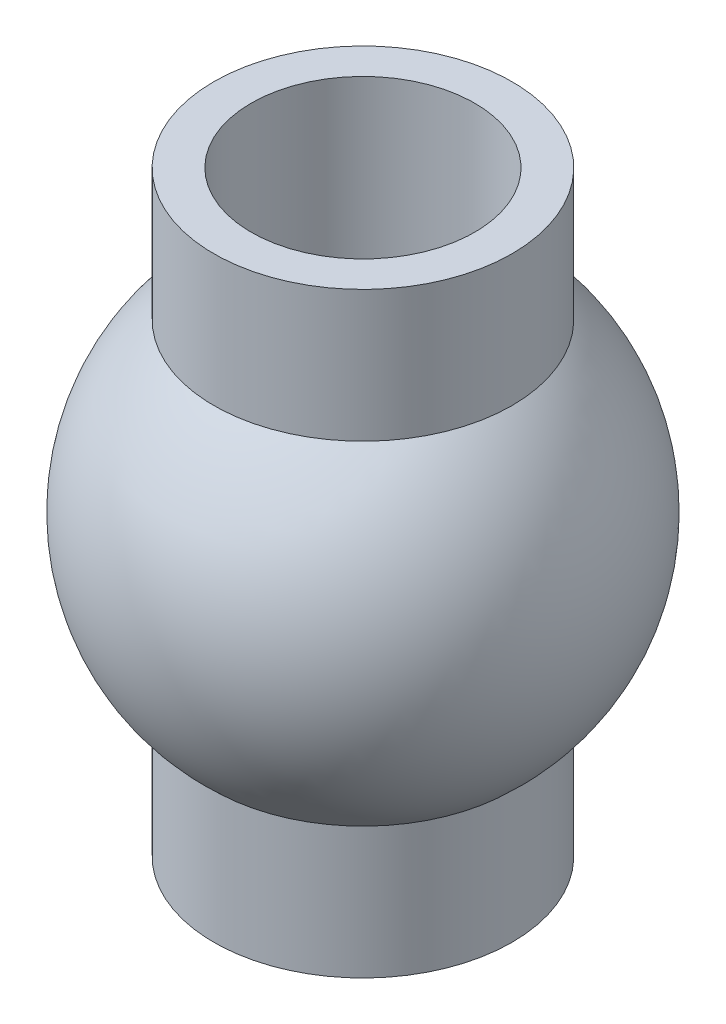
ISO-10303-21;
HEADER;
FILE_DESCRIPTION(('STEP AP214'),'2;1');
FILE_NAME('part.step','',(''),(''),'','','');
FILE_SCHEMA(('AUTOMOTIVE_DESIGN { 1 0 10303 214 1 1 1 1 }'));
ENDSEC;
DATA;
#1=APPLICATION_CONTEXT('core data for automotive mechanical design processes');
#2=APPLICATION_PROTOCOL_DEFINITION('international standard','automotive_design',2000,#1);
#3=PRODUCT_CONTEXT('',#1,'mechanical');
#4=PRODUCT('Part','Part','',(#3));
#5=PRODUCT_RELATED_PRODUCT_CATEGORY('part','',(#4));
#6=PRODUCT_DEFINITION_FORMATION('','',#4);
#7=PRODUCT_DEFINITION_CONTEXT('part definition',#1,'design');
#8=PRODUCT_DEFINITION('design','',#6,#7);
#9=PRODUCT_DEFINITION_SHAPE('','',#8);
#10=(LENGTH_UNIT() NAMED_UNIT(*) SI_UNIT(.MILLI.,.METRE.));
#11=(NAMED_UNIT(*) PLANE_ANGLE_UNIT() SI_UNIT($,.RADIAN.));
#12=(NAMED_UNIT(*) SI_UNIT($,.STERADIAN.) SOLID_ANGLE_UNIT());
#13=UNCERTAINTY_MEASURE_WITH_UNIT(LENGTH_MEASURE(1.E-05),#10,'distance_accuracy_value','');
#14=(GEOMETRIC_REPRESENTATION_CONTEXT(3) GLOBAL_UNCERTAINTY_ASSIGNED_CONTEXT((#13)) GLOBAL_UNIT_ASSIGNED_CONTEXT((#10,
#11,#12)) REPRESENTATION_CONTEXT('',''));
#15=CARTESIAN_POINT('',(0.,0.,0.));
#16=DIRECTION('',(0.,0.,1.));
#17=DIRECTION('',(1.,0.,0.));
#18=AXIS2_PLACEMENT_3D('',#15,#16,#17);
#19=CARTESIAN_POINT('',(2.,-4.,0.));
#20=DIRECTION('',(0.,1.,0.));
#21=DIRECTION('',(-1.,0.,0.));
#22=AXIS2_PLACEMENT_3D('',#19,#20,#21);
#23=PLANE('',#22);
#24=CARTESIAN_POINT('',(0.,-4.,0.));
#25=DIRECTION('',(0.,1.,0.));
#26=DIRECTION('',(-1.,0.,0.));
#27=AXIS2_PLACEMENT_3D('',#24,#25,#26);
#28=CIRCLE('',#27,2.);
#29=CARTESIAN_POINT('',(-2.,-4.,0.));
#30=VERTEX_POINT('',#29);
#31=EDGE_CURVE('E53',#30,#30,#28,.T.);
#32=ORIENTED_EDGE('',*,*,#31,.F.);
#33=EDGE_LOOP('',(#32));
#34=FACE_BOUND('',#33,.T.);
#35=CARTESIAN_POINT('',(0.,-4.,0.));
#36=DIRECTION('',(0.,1.,0.));
#37=DIRECTION('',(-1.,0.,0.));
#38=AXIS2_PLACEMENT_3D('',#35,#36,#37);
#39=CIRCLE('',#38,1.5);
#40=CARTESIAN_POINT('',(-1.5,-4.,0.));
#41=VERTEX_POINT('',#40);
#42=EDGE_CURVE('E10',#41,#41,#39,.T.);
#43=ORIENTED_EDGE('',*,*,#42,.T.);
#44=EDGE_LOOP('',(#43));
#45=FACE_BOUND('',#44,.T.);
#46=ADVANCED_FACE('F31',(#34,#45),#23,.F.);
#47=CARTESIAN_POINT('',(0.,10.9318920301606,0.));
#48=DIRECTION('',(0.,1.,0.));
#49=DIRECTION('',(-1.,0.,0.));
#50=AXIS2_PLACEMENT_3D('',#47,#48,#49);
#51=CYLINDRICAL_SURFACE('',#50,1.5);
#52=ORIENTED_EDGE('',*,*,#42,.F.);
#53=EDGE_LOOP('',(#52));
#54=FACE_BOUND('',#53,.T.);
#55=CARTESIAN_POINT('',(0.,4.,0.));
#56=DIRECTION('',(0.,1.,0.));
#57=DIRECTION('',(-1.,0.,0.));
#58=AXIS2_PLACEMENT_3D('',#55,#56,#57);
#59=CIRCLE('',#58,1.5);
#60=CARTESIAN_POINT('',(-1.5,4.,0.));
#61=VERTEX_POINT('',#60);
#62=EDGE_CURVE('E37',#61,#61,#59,.T.);
#63=ORIENTED_EDGE('',*,*,#62,.T.);
#64=EDGE_LOOP('',(#63));
#65=FACE_BOUND('',#64,.T.);
#66=ADVANCED_FACE('F60',(#54,#65),#51,.F.);
#67=CARTESIAN_POINT('',(1.5,4.,0.));
#68=DIRECTION('',(0.,-1.,0.));
#69=DIRECTION('',(1.,0.,0.));
#70=AXIS2_PLACEMENT_3D('',#67,#68,#69);
#71=PLANE('',#70);
#72=ORIENTED_EDGE('',*,*,#62,.F.);
#73=EDGE_LOOP('',(#72));
#74=FACE_BOUND('',#73,.T.);
#75=CARTESIAN_POINT('',(0.,4.,0.));
#76=DIRECTION('',(0.,1.,0.));
#77=DIRECTION('',(-1.,0.,0.));
#78=AXIS2_PLACEMENT_3D('',#75,#76,#77);
#79=CIRCLE('',#78,2.);
#80=CARTESIAN_POINT('',(-2.,4.,0.));
#81=VERTEX_POINT('',#80);
#82=EDGE_CURVE('E41',#81,#81,#79,.T.);
#83=ORIENTED_EDGE('',*,*,#82,.T.);
#84=EDGE_LOOP('',(#83));
#85=FACE_BOUND('',#84,.T.);
#86=ADVANCED_FACE('F64',(#74,#85),#71,.F.);
#87=CARTESIAN_POINT('',(0.,10.9318920301606,0.));
#88=DIRECTION('',(0.,1.,0.));
#89=DIRECTION('',(-1.,0.,0.));
#90=AXIS2_PLACEMENT_3D('',#87,#88,#89);
#91=CYLINDRICAL_SURFACE('',#90,2.);
#92=ORIENTED_EDGE('',*,*,#82,.F.);
#93=EDGE_LOOP('',(#92));
#94=FACE_BOUND('',#93,.T.);
#95=CARTESIAN_POINT('',(0.,2.23606797749979,0.));
#96=DIRECTION('',(0.,1.,0.));
#97=DIRECTION('',(-1.,0.,0.));
#98=AXIS2_PLACEMENT_3D('',#95,#96,#97);
#99=CIRCLE('',#98,2.);
#100=CARTESIAN_POINT('',(-2.,2.23606797749979,0.));
#101=VERTEX_POINT('',#100);
#102=EDGE_CURVE('E45',#101,#101,#99,.T.);
#103=ORIENTED_EDGE('',*,*,#102,.T.);
#104=EDGE_LOOP('',(#103));
#105=FACE_BOUND('',#104,.T.);
#106=ADVANCED_FACE('F69',(#94,#105),#91,.T.);
#107=CARTESIAN_POINT('',(0.,0.,0.));
#108=DIRECTION('',(0.,1.,0.));
#109=DIRECTION('',(1.,0.,0.));
#110=AXIS2_PLACEMENT_3D('',#107,#108,#109);
#111=SPHERICAL_SURFACE('',#110,3.);
#112=ORIENTED_EDGE('',*,*,#102,.F.);
#113=EDGE_LOOP('',(#112));
#114=FACE_BOUND('',#113,.T.);
#115=CARTESIAN_POINT('',(0.,-2.23606797749979,0.));
#116=DIRECTION('',(0.,1.,0.));
#117=DIRECTION('',(-1.,0.,0.));
#118=AXIS2_PLACEMENT_3D('',#115,#116,#117);
#119=CIRCLE('',#118,2.);
#120=CARTESIAN_POINT('',(-2.,-2.23606797749979,0.));
#121=VERTEX_POINT('',#120);
#122=EDGE_CURVE('E50',#121,#121,#119,.T.);
#123=ORIENTED_EDGE('',*,*,#122,.T.);
#124=EDGE_LOOP('',(#123));
#125=FACE_BOUND('',#124,.T.);
#126=ADVANCED_FACE('F75',(#114,#125),#111,.T.);
#127=CARTESIAN_POINT('',(0.,10.9318920301606,0.));
#128=DIRECTION('',(0.,1.,0.));
#129=DIRECTION('',(-1.,0.,0.));
#130=AXIS2_PLACEMENT_3D('',#127,#128,#129);
#131=CYLINDRICAL_SURFACE('',#130,2.);
#132=ORIENTED_EDGE('',*,*,#122,.F.);
#133=EDGE_LOOP('',(#132));
#134=FACE_BOUND('',#133,.T.);
#135=ORIENTED_EDGE('',*,*,#31,.T.);
#136=EDGE_LOOP('',(#135));
#137=FACE_BOUND('',#136,.T.);
#138=ADVANCED_FACE('F57',(#134,#137),#131,.T.);
#139=CLOSED_SHELL('',(#46,#66,#86,#106,#126,#138));
#140=MANIFOLD_SOLID_BREP('B2',#139);
#141=ADVANCED_BREP_SHAPE_REPRESENTATION('',(#18,#140),#14);
#142=SHAPE_DEFINITION_REPRESENTATION(#9,#141);
ENDSEC;
END-ISO-10303-21;
